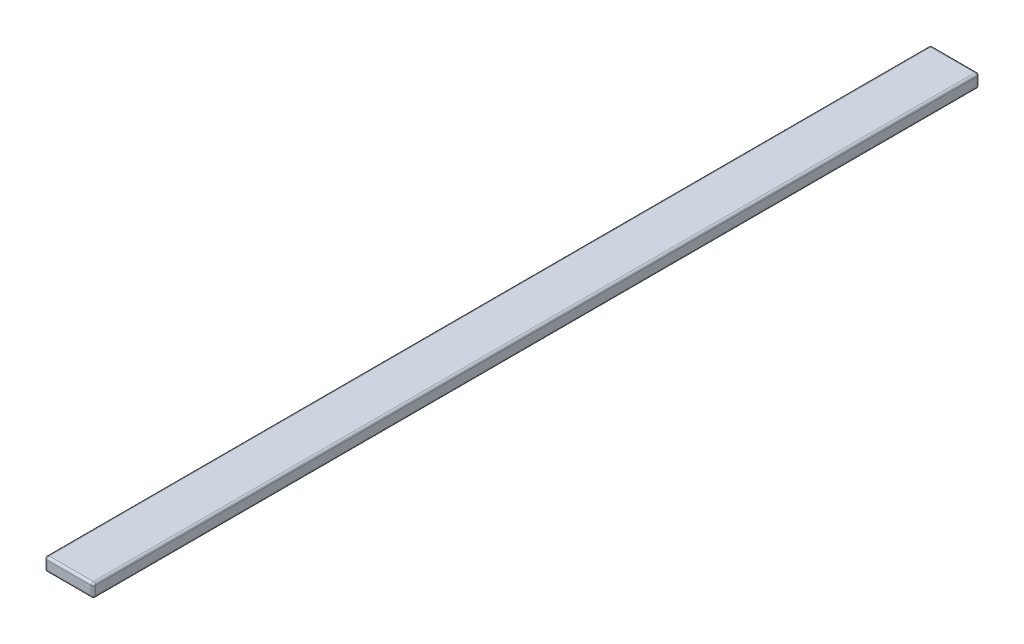
ISO-10303-21;
HEADER;
FILE_DESCRIPTION(('STEP AP214'),'2;1');
FILE_NAME('part.step','',(''),(''),'','','');
FILE_SCHEMA(('AUTOMOTIVE_DESIGN { 1 0 10303 214 1 1 1 1 }'));
ENDSEC;
DATA;
#1=APPLICATION_CONTEXT('core data for automotive mechanical design processes');
#2=APPLICATION_PROTOCOL_DEFINITION('international standard','automotive_design',2000,#1);
#3=PRODUCT_CONTEXT('',#1,'mechanical');
#4=PRODUCT('Part','Part','',(#3));
#5=PRODUCT_RELATED_PRODUCT_CATEGORY('part','',(#4));
#6=PRODUCT_DEFINITION_FORMATION('','',#4);
#7=PRODUCT_DEFINITION_CONTEXT('part definition',#1,'design');
#8=PRODUCT_DEFINITION('design','',#6,#7);
#9=PRODUCT_DEFINITION_SHAPE('','',#8);
#10=(LENGTH_UNIT() NAMED_UNIT(*) SI_UNIT(.MILLI.,.METRE.));
#11=(NAMED_UNIT(*) PLANE_ANGLE_UNIT() SI_UNIT($,.RADIAN.));
#12=(NAMED_UNIT(*) SI_UNIT($,.STERADIAN.) SOLID_ANGLE_UNIT());
#13=UNCERTAINTY_MEASURE_WITH_UNIT(LENGTH_MEASURE(1.E-05),#10,'distance_accuracy_value','');
#14=(GEOMETRIC_REPRESENTATION_CONTEXT(3) GLOBAL_UNCERTAINTY_ASSIGNED_CONTEXT((#13)) GLOBAL_UNIT_ASSIGNED_CONTEXT((#10,
#11,#12)) REPRESENTATION_CONTEXT('',''));
#15=CARTESIAN_POINT('',(0.,0.,0.));
#16=DIRECTION('',(0.,0.,1.));
#17=DIRECTION('',(1.,0.,0.));
#18=AXIS2_PLACEMENT_3D('',#15,#16,#17);
#19=CARTESIAN_POINT('',(11.,-3.,400.));
#20=DIRECTION('',(-1.,0.,0.));
#21=DIRECTION('',(0.,0.,1.));
#22=AXIS2_PLACEMENT_3D('',#19,#20,#21);
#23=PLANE('',#22);
#24=DIRECTION('',(0.,1.,0.));
#25=VECTOR('',#24,1.);
#26=CARTESIAN_POINT('',(11.,-3.,399.));
#27=LINE('',#26,#25);
#28=CARTESIAN_POINT('',(11.,2.,399.));
#29=VERTEX_POINT('',#28);
#30=CARTESIAN_POINT('',(11.,-2.,399.));
#31=VERTEX_POINT('',#30);
#32=EDGE_CURVE('E192',#29,#31,#27,.F.);
#33=ORIENTED_EDGE('',*,*,#32,.T.);
#34=DIRECTION('',(0.,0.,-1.));
#35=VECTOR('',#34,1.);
#36=CARTESIAN_POINT('',(11.,-2.,400.));
#37=LINE('',#36,#35);
#38=CARTESIAN_POINT('',(11.,-2.,1.));
#39=VERTEX_POINT('',#38);
#40=EDGE_CURVE('E195',#31,#39,#37,.T.);
#41=ORIENTED_EDGE('',*,*,#40,.T.);
#42=DIRECTION('',(0.,1.,0.));
#43=VECTOR('',#42,1.);
#44=CARTESIAN_POINT('',(11.,3.,1.));
#45=LINE('',#44,#43);
#46=CARTESIAN_POINT('',(11.,2.,1.));
#47=VERTEX_POINT('',#46);
#48=EDGE_CURVE('E190',#39,#47,#45,.T.);
#49=ORIENTED_EDGE('',*,*,#48,.T.);
#50=DIRECTION('',(0.,0.,-1.));
#51=VECTOR('',#50,1.);
#52=CARTESIAN_POINT('',(11.,2.,400.));
#53=LINE('',#52,#51);
#54=EDGE_CURVE('E188',#47,#29,#53,.F.);
#55=ORIENTED_EDGE('',*,*,#54,.T.);
#56=EDGE_LOOP('',(#33,#41,#49,#55));
#57=FACE_BOUND('',#56,.T.);
#58=ADVANCED_FACE('F36',(#57),#23,.F.);
#59=CARTESIAN_POINT('',(-11.,3.,400.));
#60=DIRECTION('',(0.,-1.,0.));
#61=DIRECTION('',(0.,0.,-1.));
#62=AXIS2_PLACEMENT_3D('',#59,#60,#61);
#63=PLANE('',#62);
#64=DIRECTION('',(-1.,0.,0.));
#65=VECTOR('',#64,1.);
#66=CARTESIAN_POINT('',(-11.,3.,1.));
#67=LINE('',#66,#65);
#68=CARTESIAN_POINT('',(10.,3.,1.));
#69=VERTEX_POINT('',#68);
#70=CARTESIAN_POINT('',(-10.,3.,1.));
#71=VERTEX_POINT('',#70);
#72=EDGE_CURVE('E181',#69,#71,#67,.T.);
#73=ORIENTED_EDGE('',*,*,#72,.T.);
#74=DIRECTION('',(0.,0.,-1.));
#75=VECTOR('',#74,1.);
#76=CARTESIAN_POINT('',(-10.,3.,400.));
#77=LINE('',#76,#75);
#78=CARTESIAN_POINT('',(-10.,3.,399.));
#79=VERTEX_POINT('',#78);
#80=EDGE_CURVE('E186',#71,#79,#77,.F.);
#81=ORIENTED_EDGE('',*,*,#80,.T.);
#82=DIRECTION('',(-1.,0.,0.));
#83=VECTOR('',#82,1.);
#84=CARTESIAN_POINT('',(-11.,3.,399.));
#85=LINE('',#84,#83);
#86=CARTESIAN_POINT('',(10.,3.,399.));
#87=VERTEX_POINT('',#86);
#88=EDGE_CURVE('E183',#79,#87,#85,.F.);
#89=ORIENTED_EDGE('',*,*,#88,.T.);
#90=DIRECTION('',(0.,0.,-1.));
#91=VECTOR('',#90,1.);
#92=CARTESIAN_POINT('',(10.,3.,400.));
#93=LINE('',#92,#91);
#94=EDGE_CURVE('E179',#87,#69,#93,.T.);
#95=ORIENTED_EDGE('',*,*,#94,.T.);
#96=EDGE_LOOP('',(#73,#81,#89,#95));
#97=FACE_BOUND('',#96,.T.);
#98=ADVANCED_FACE('F282',(#97),#63,.F.);
#99=CARTESIAN_POINT('',(-11.,-3.,400.));
#100=DIRECTION('',(1.,0.,0.));
#101=DIRECTION('',(0.,0.,-1.));
#102=AXIS2_PLACEMENT_3D('',#99,#100,#101);
#103=PLANE('',#102);
#104=DIRECTION('',(0.,-1.,0.));
#105=VECTOR('',#104,1.);
#106=CARTESIAN_POINT('',(-11.,-3.,399.));
#107=LINE('',#106,#105);
#108=CARTESIAN_POINT('',(-11.,-2.,399.));
#109=VERTEX_POINT('',#108);
#110=CARTESIAN_POINT('',(-11.,2.,399.));
#111=VERTEX_POINT('',#110);
#112=EDGE_CURVE('E174',#109,#111,#107,.F.);
#113=ORIENTED_EDGE('',*,*,#112,.T.);
#114=DIRECTION('',(0.,0.,-1.));
#115=VECTOR('',#114,1.);
#116=CARTESIAN_POINT('',(-11.,2.,400.));
#117=LINE('',#116,#115);
#118=CARTESIAN_POINT('',(-11.,2.,1.));
#119=VERTEX_POINT('',#118);
#120=EDGE_CURVE('E177',#111,#119,#117,.T.);
#121=ORIENTED_EDGE('',*,*,#120,.T.);
#122=DIRECTION('',(0.,-1.,0.));
#123=VECTOR('',#122,1.);
#124=CARTESIAN_POINT('',(-11.,-3.,1.));
#125=LINE('',#124,#123);
#126=CARTESIAN_POINT('',(-11.,-2.,1.));
#127=VERTEX_POINT('',#126);
#128=EDGE_CURVE('E172',#119,#127,#125,.T.);
#129=ORIENTED_EDGE('',*,*,#128,.T.);
#130=DIRECTION('',(0.,0.,-1.));
#131=VECTOR('',#130,1.);
#132=CARTESIAN_POINT('',(-11.,-2.,400.));
#133=LINE('',#132,#131);
#134=EDGE_CURVE('E170',#127,#109,#133,.F.);
#135=ORIENTED_EDGE('',*,*,#134,.T.);
#136=EDGE_LOOP('',(#113,#121,#129,#135));
#137=FACE_BOUND('',#136,.T.);
#138=ADVANCED_FACE('F273',(#137),#103,.F.);
#139=CARTESIAN_POINT('',(-11.,-3.,400.));
#140=DIRECTION('',(0.,1.,0.));
#141=DIRECTION('',(0.,0.,1.));
#142=AXIS2_PLACEMENT_3D('',#139,#140,#141);
#143=PLANE('',#142);
#144=DIRECTION('',(1.,0.,0.));
#145=VECTOR('',#144,1.);
#146=CARTESIAN_POINT('',(-11.,-3.,399.));
#147=LINE('',#146,#145);
#148=CARTESIAN_POINT('',(10.,-3.,399.));
#149=VERTEX_POINT('',#148);
#150=CARTESIAN_POINT('',(-10.,-3.,399.));
#151=VERTEX_POINT('',#150);
#152=EDGE_CURVE('E131',#149,#151,#147,.F.);
#153=ORIENTED_EDGE('',*,*,#152,.T.);
#154=DIRECTION('',(0.,0.,-1.));
#155=VECTOR('',#154,1.);
#156=CARTESIAN_POINT('',(-10.,-3.,400.));
#157=LINE('',#156,#155);
#158=CARTESIAN_POINT('',(-10.,-3.,1.));
#159=VERTEX_POINT('',#158);
#160=EDGE_CURVE('E168',#151,#159,#157,.T.);
#161=ORIENTED_EDGE('',*,*,#160,.T.);
#162=DIRECTION('',(1.,0.,0.));
#163=VECTOR('',#162,1.);
#164=CARTESIAN_POINT('',(11.,-3.,1.));
#165=LINE('',#164,#163);
#166=CARTESIAN_POINT('',(10.,-3.,1.));
#167=VERTEX_POINT('',#166);
#168=EDGE_CURVE('E161',#159,#167,#165,.T.);
#169=ORIENTED_EDGE('',*,*,#168,.T.);
#170=DIRECTION('',(0.,0.,-1.));
#171=VECTOR('',#170,1.);
#172=CARTESIAN_POINT('',(10.,-3.,400.));
#173=LINE('',#172,#171);
#174=EDGE_CURVE('E159',#167,#149,#173,.F.);
#175=ORIENTED_EDGE('',*,*,#174,.T.);
#176=EDGE_LOOP('',(#153,#161,#169,#175));
#177=FACE_BOUND('',#176,.T.);
#178=ADVANCED_FACE('F310',(#177),#143,.F.);
#179=CARTESIAN_POINT('',(0.,0.,400.));
#180=DIRECTION('',(0.,0.,-1.));
#181=DIRECTION('',(-1.,0.,0.));
#182=AXIS2_PLACEMENT_3D('',#179,#180,#181);
#183=PLANE('',#182);
#184=DIRECTION('',(0.,-1.,0.));
#185=VECTOR('',#184,1.);
#186=CARTESIAN_POINT('',(-10.,0.,400.));
#187=LINE('',#186,#185);
#188=CARTESIAN_POINT('',(-10.,2.,400.));
#189=VERTEX_POINT('',#188);
#190=CARTESIAN_POINT('',(-10.,-2.,400.));
#191=VERTEX_POINT('',#190);
#192=EDGE_CURVE('E157',#189,#191,#187,.T.);
#193=ORIENTED_EDGE('',*,*,#192,.T.);
#194=DIRECTION('',(1.,0.,0.));
#195=VECTOR('',#194,1.);
#196=CARTESIAN_POINT('',(0.,-2.,400.));
#197=LINE('',#196,#195);
#198=CARTESIAN_POINT('',(10.,-2.,400.));
#199=VERTEX_POINT('',#198);
#200=EDGE_CURVE('E129',#191,#199,#197,.T.);
#201=ORIENTED_EDGE('',*,*,#200,.T.);
#202=DIRECTION('',(0.,1.,0.));
#203=VECTOR('',#202,1.);
#204=CARTESIAN_POINT('',(10.,0.,400.));
#205=LINE('',#204,#203);
#206=CARTESIAN_POINT('',(10.,2.,400.));
#207=VERTEX_POINT('',#206);
#208=EDGE_CURVE('E147',#199,#207,#205,.T.);
#209=ORIENTED_EDGE('',*,*,#208,.T.);
#210=DIRECTION('',(-1.,0.,0.));
#211=VECTOR('',#210,1.);
#212=CARTESIAN_POINT('',(0.,2.,400.));
#213=LINE('',#212,#211);
#214=EDGE_CURVE('E153',#207,#189,#213,.T.);
#215=ORIENTED_EDGE('',*,*,#214,.T.);
#216=EDGE_LOOP('',(#193,#201,#209,#215));
#217=FACE_BOUND('',#216,.T.);
#218=ADVANCED_FACE('F155',(#217),#183,.F.);
#219=CARTESIAN_POINT('',(0.,0.,0.));
#220=DIRECTION('',(0.,0.,-1.));
#221=DIRECTION('',(-1.,0.,0.));
#222=AXIS2_PLACEMENT_3D('',#219,#220,#221);
#223=PLANE('',#222);
#224=DIRECTION('',(0.,-1.,0.));
#225=VECTOR('',#224,1.);
#226=CARTESIAN_POINT('',(-10.,3.,0.));
#227=LINE('',#226,#225);
#228=CARTESIAN_POINT('',(-10.,-2.,0.));
#229=VERTEX_POINT('',#228);
#230=CARTESIAN_POINT('',(-10.,2.,0.));
#231=VERTEX_POINT('',#230);
#232=EDGE_CURVE('E45',#229,#231,#227,.F.);
#233=ORIENTED_EDGE('',*,*,#232,.T.);
#234=DIRECTION('',(-1.,0.,0.));
#235=VECTOR('',#234,1.);
#236=CARTESIAN_POINT('',(11.,2.,0.));
#237=LINE('',#236,#235);
#238=CARTESIAN_POINT('',(10.,2.,0.));
#239=VERTEX_POINT('',#238);
#240=EDGE_CURVE('E11',#231,#239,#237,.F.);
#241=ORIENTED_EDGE('',*,*,#240,.T.);
#242=DIRECTION('',(0.,1.,0.));
#243=VECTOR('',#242,1.);
#244=CARTESIAN_POINT('',(10.,-3.,0.));
#245=LINE('',#244,#243);
#246=CARTESIAN_POINT('',(10.,-2.,0.));
#247=VERTEX_POINT('',#246);
#248=EDGE_CURVE('E197',#239,#247,#245,.F.);
#249=ORIENTED_EDGE('',*,*,#248,.T.);
#250=DIRECTION('',(1.,0.,0.));
#251=VECTOR('',#250,1.);
#252=CARTESIAN_POINT('',(-11.,-2.,0.));
#253=LINE('',#252,#251);
#254=EDGE_CURVE('E56',#247,#229,#253,.F.);
#255=ORIENTED_EDGE('',*,*,#254,.T.);
#256=EDGE_LOOP('',(#233,#241,#249,#255));
#257=FACE_BOUND('',#256,.T.);
#258=ADVANCED_FACE('F294',(#257),#223,.T.);
#259=CARTESIAN_POINT('',(-11.,2.,1.));
#260=DIRECTION('',(1.,0.,0.));
#261=DIRECTION('',(0.,0.,-1.));
#262=AXIS2_PLACEMENT_3D('',#259,#260,#261);
#263=CYLINDRICAL_SURFACE('',#262,1.);
#264=CARTESIAN_POINT('',(-10.,2.,1.));
#265=DIRECTION('',(-1.,0.,0.));
#266=DIRECTION('',(0.,0.,1.));
#267=AXIS2_PLACEMENT_3D('',#264,#265,#266);
#268=CIRCLE('',#267,1.);
#269=EDGE_CURVE('E40',#71,#231,#268,.T.);
#270=ORIENTED_EDGE('',*,*,#269,.F.);
#271=ORIENTED_EDGE('',*,*,#72,.F.);
#272=CARTESIAN_POINT('',(10.,2.,1.));
#273=DIRECTION('',(1.,0.,0.));
#274=DIRECTION('',(0.,1.,0.));
#275=AXIS2_PLACEMENT_3D('',#272,#273,#274);
#276=CIRCLE('',#275,1.);
#277=EDGE_CURVE('E251',#239,#69,#276,.T.);
#278=ORIENTED_EDGE('',*,*,#277,.F.);
#279=ORIENTED_EDGE('',*,*,#240,.F.);
#280=EDGE_LOOP('',(#270,#271,#278,#279));
#281=FACE_BOUND('',#280,.T.);
#282=ADVANCED_FACE('F38',(#281),#263,.T.);
#283=CARTESIAN_POINT('',(-10.,2.,1.));
#284=DIRECTION('',(0.,0.,1.));
#285=DIRECTION('',(1.,0.,0.));
#286=AXIS2_PLACEMENT_3D('',#283,#284,#285);
#287=SPHERICAL_SURFACE('',#286,1.);
#288=CARTESIAN_POINT('',(-10.,2.,1.));
#289=DIRECTION('',(0.,0.,-1.));
#290=DIRECTION('',(-1.,0.,0.));
#291=AXIS2_PLACEMENT_3D('',#288,#289,#290);
#292=CIRCLE('',#291,1.);
#293=EDGE_CURVE('E246',#71,#119,#292,.F.);
#294=ORIENTED_EDGE('',*,*,#293,.F.);
#295=ORIENTED_EDGE('',*,*,#269,.T.);
#296=CARTESIAN_POINT('',(-10.,2.,1.));
#297=DIRECTION('',(0.,1.,0.));
#298=DIRECTION('',(0.,0.,1.));
#299=AXIS2_PLACEMENT_3D('',#296,#297,#298);
#300=CIRCLE('',#299,1.);
#301=EDGE_CURVE('E249',#119,#231,#300,.F.);
#302=ORIENTED_EDGE('',*,*,#301,.F.);
#303=EDGE_LOOP('',(#294,#295,#302));
#304=FACE_BOUND('',#303,.T.);
#305=ADVANCED_FACE('F262',(#304),#287,.T.);
#306=CARTESIAN_POINT('',(10.,2.,1.));
#307=DIRECTION('',(0.,0.,1.));
#308=DIRECTION('',(1.,0.,0.));
#309=AXIS2_PLACEMENT_3D('',#306,#307,#308);
#310=SPHERICAL_SURFACE('',#309,1.);
#311=CARTESIAN_POINT('',(10.,2.,1.));
#312=DIRECTION('',(0.,1.,0.));
#313=DIRECTION('',(0.,0.,1.));
#314=AXIS2_PLACEMENT_3D('',#311,#312,#313);
#315=CIRCLE('',#314,1.);
#316=EDGE_CURVE('E240',#239,#47,#315,.F.);
#317=ORIENTED_EDGE('',*,*,#316,.F.);
#318=ORIENTED_EDGE('',*,*,#277,.T.);
#319=CARTESIAN_POINT('',(10.,2.,1.));
#320=DIRECTION('',(0.,0.,-1.));
#321=DIRECTION('',(-1.,0.,0.));
#322=AXIS2_PLACEMENT_3D('',#319,#320,#321);
#323=CIRCLE('',#322,1.);
#324=EDGE_CURVE('E243',#47,#69,#323,.F.);
#325=ORIENTED_EDGE('',*,*,#324,.F.);
#326=EDGE_LOOP('',(#317,#318,#325));
#327=FACE_BOUND('',#326,.T.);
#328=ADVANCED_FACE('F461',(#327),#310,.T.);
#329=CARTESIAN_POINT('',(-10.,-3.,1.));
#330=DIRECTION('',(0.,1.,0.));
#331=DIRECTION('',(0.,0.,1.));
#332=AXIS2_PLACEMENT_3D('',#329,#330,#331);
#333=CYLINDRICAL_SURFACE('',#332,1.);
#334=ORIENTED_EDGE('',*,*,#301,.T.);
#335=ORIENTED_EDGE('',*,*,#232,.F.);
#336=CARTESIAN_POINT('',(-10.,-2.,1.));
#337=DIRECTION('',(0.,-1.,0.));
#338=DIRECTION('',(0.,0.,-1.));
#339=AXIS2_PLACEMENT_3D('',#336,#337,#338);
#340=CIRCLE('',#339,1.);
#341=EDGE_CURVE('E234',#127,#229,#340,.T.);
#342=ORIENTED_EDGE('',*,*,#341,.F.);
#343=ORIENTED_EDGE('',*,*,#128,.F.);
#344=EDGE_LOOP('',(#334,#335,#342,#343));
#345=FACE_BOUND('',#344,.T.);
#346=ADVANCED_FACE('F268',(#345),#333,.T.);
#347=CARTESIAN_POINT('',(-10.,2.,400.));
#348=DIRECTION('',(0.,0.,-1.));
#349=DIRECTION('',(-1.,0.,0.));
#350=AXIS2_PLACEMENT_3D('',#347,#348,#349);
#351=CYLINDRICAL_SURFACE('',#350,1.);
#352=ORIENTED_EDGE('',*,*,#293,.T.);
#353=ORIENTED_EDGE('',*,*,#120,.F.);
#354=CARTESIAN_POINT('',(-10.,2.,399.));
#355=DIRECTION('',(0.,0.,1.));
#356=DIRECTION('',(1.,0.,0.));
#357=AXIS2_PLACEMENT_3D('',#354,#355,#356);
#358=CIRCLE('',#357,1.);
#359=EDGE_CURVE('E231',#79,#111,#358,.T.);
#360=ORIENTED_EDGE('',*,*,#359,.F.);
#361=ORIENTED_EDGE('',*,*,#80,.F.);
#362=EDGE_LOOP('',(#352,#353,#360,#361));
#363=FACE_BOUND('',#362,.T.);
#364=ADVANCED_FACE('F279',(#363),#351,.T.);
#365=CARTESIAN_POINT('',(0.,2.,399.));
#366=DIRECTION('',(-1.,0.,0.));
#367=DIRECTION('',(0.,0.,1.));
#368=AXIS2_PLACEMENT_3D('',#365,#366,#367);
#369=CYLINDRICAL_SURFACE('',#368,1.);
#370=CARTESIAN_POINT('',(10.,2.,399.));
#371=DIRECTION('',(1.,0.,0.));
#372=DIRECTION('',(0.,0.,-1.));
#373=AXIS2_PLACEMENT_3D('',#370,#371,#372);
#374=CIRCLE('',#373,1.);
#375=EDGE_CURVE('E225',#87,#207,#374,.T.);
#376=ORIENTED_EDGE('',*,*,#375,.F.);
#377=ORIENTED_EDGE('',*,*,#88,.F.);
#378=CARTESIAN_POINT('',(-10.,2.,399.));
#379=DIRECTION('',(-1.,0.,0.));
#380=DIRECTION('',(0.,0.,1.));
#381=AXIS2_PLACEMENT_3D('',#378,#379,#380);
#382=CIRCLE('',#381,1.);
#383=EDGE_CURVE('E228',#189,#79,#382,.T.);
#384=ORIENTED_EDGE('',*,*,#383,.F.);
#385=ORIENTED_EDGE('',*,*,#214,.F.);
#386=EDGE_LOOP('',(#376,#377,#384,#385));
#387=FACE_BOUND('',#386,.T.);
#388=ADVANCED_FACE('F286',(#387),#369,.T.);
#389=CARTESIAN_POINT('',(10.,2.,400.));
#390=DIRECTION('',(0.,0.,-1.));
#391=DIRECTION('',(-1.,0.,0.));
#392=AXIS2_PLACEMENT_3D('',#389,#390,#391);
#393=CYLINDRICAL_SURFACE('',#392,1.);
#394=ORIENTED_EDGE('',*,*,#324,.T.);
#395=ORIENTED_EDGE('',*,*,#94,.F.);
#396=CARTESIAN_POINT('',(10.,2.,399.));
#397=DIRECTION('',(0.,0.,1.));
#398=DIRECTION('',(1.,0.,0.));
#399=AXIS2_PLACEMENT_3D('',#396,#397,#398);
#400=CIRCLE('',#399,1.);
#401=EDGE_CURVE('E223',#29,#87,#400,.T.);
#402=ORIENTED_EDGE('',*,*,#401,.F.);
#403=ORIENTED_EDGE('',*,*,#54,.F.);
#404=EDGE_LOOP('',(#394,#395,#402,#403));
#405=FACE_BOUND('',#404,.T.);
#406=ADVANCED_FACE('F292',(#405),#393,.T.);
#407=CARTESIAN_POINT('',(10.,-3.,1.));
#408=DIRECTION('',(0.,-1.,0.));
#409=DIRECTION('',(0.,0.,-1.));
#410=AXIS2_PLACEMENT_3D('',#407,#408,#409);
#411=CYLINDRICAL_SURFACE('',#410,1.);
#412=ORIENTED_EDGE('',*,*,#316,.T.);
#413=ORIENTED_EDGE('',*,*,#48,.F.);
#414=CARTESIAN_POINT('',(10.,-2.,1.));
#415=DIRECTION('',(0.,-1.,0.));
#416=DIRECTION('',(0.,0.,-1.));
#417=AXIS2_PLACEMENT_3D('',#414,#415,#416);
#418=CIRCLE('',#417,1.);
#419=EDGE_CURVE('E220',#247,#39,#418,.T.);
#420=ORIENTED_EDGE('',*,*,#419,.F.);
#421=ORIENTED_EDGE('',*,*,#248,.F.);
#422=EDGE_LOOP('',(#412,#413,#420,#421));
#423=FACE_BOUND('',#422,.T.);
#424=ADVANCED_FACE('F303',(#423),#411,.T.);
#425=CARTESIAN_POINT('',(-11.,-2.,1.));
#426=DIRECTION('',(-1.,0.,0.));
#427=DIRECTION('',(0.,0.,1.));
#428=AXIS2_PLACEMENT_3D('',#425,#426,#427);
#429=CYLINDRICAL_SURFACE('',#428,1.);
#430=CARTESIAN_POINT('',(-10.,-2.,1.));
#431=DIRECTION('',(-1.,0.,0.));
#432=DIRECTION('',(0.,0.,1.));
#433=AXIS2_PLACEMENT_3D('',#430,#431,#432);
#434=CIRCLE('',#433,1.);
#435=EDGE_CURVE('E237',#229,#159,#434,.T.);
#436=ORIENTED_EDGE('',*,*,#435,.F.);
#437=ORIENTED_EDGE('',*,*,#254,.F.);
#438=CARTESIAN_POINT('',(10.,-2.,1.));
#439=DIRECTION('',(1.,0.,0.));
#440=DIRECTION('',(0.,0.,-1.));
#441=AXIS2_PLACEMENT_3D('',#438,#439,#440);
#442=CIRCLE('',#441,1.);
#443=EDGE_CURVE('E217',#167,#247,#442,.T.);
#444=ORIENTED_EDGE('',*,*,#443,.F.);
#445=ORIENTED_EDGE('',*,*,#168,.F.);
#446=EDGE_LOOP('',(#436,#437,#444,#445));
#447=FACE_BOUND('',#446,.T.);
#448=ADVANCED_FACE('F299',(#447),#429,.T.);
#449=CARTESIAN_POINT('',(-10.,-2.,1.));
#450=DIRECTION('',(0.,0.,1.));
#451=DIRECTION('',(1.,0.,0.));
#452=AXIS2_PLACEMENT_3D('',#449,#450,#451);
#453=SPHERICAL_SURFACE('',#452,1.);
#454=ORIENTED_EDGE('',*,*,#341,.T.);
#455=ORIENTED_EDGE('',*,*,#435,.T.);
#456=CARTESIAN_POINT('',(-10.,-2.,1.));
#457=DIRECTION('',(0.,0.,-1.));
#458=DIRECTION('',(-1.,0.,0.));
#459=AXIS2_PLACEMENT_3D('',#456,#457,#458);
#460=CIRCLE('',#459,1.);
#461=EDGE_CURVE('E214',#127,#159,#460,.F.);
#462=ORIENTED_EDGE('',*,*,#461,.F.);
#463=EDGE_LOOP('',(#454,#455,#462));
#464=FACE_BOUND('',#463,.T.);
#465=ADVANCED_FACE('F313',(#464),#453,.T.);
#466=CARTESIAN_POINT('',(-10.,2.,399.));
#467=DIRECTION('',(0.,0.,1.));
#468=DIRECTION('',(1.,0.,0.));
#469=AXIS2_PLACEMENT_3D('',#466,#467,#468);
#470=SPHERICAL_SURFACE('',#469,1.);
#471=ORIENTED_EDGE('',*,*,#383,.T.);
#472=ORIENTED_EDGE('',*,*,#359,.T.);
#473=CARTESIAN_POINT('',(-10.,2.,399.));
#474=DIRECTION('',(0.,1.,0.));
#475=DIRECTION('',(0.,0.,1.));
#476=AXIS2_PLACEMENT_3D('',#473,#474,#475);
#477=CIRCLE('',#476,1.);
#478=EDGE_CURVE('E212',#189,#111,#477,.F.);
#479=ORIENTED_EDGE('',*,*,#478,.F.);
#480=EDGE_LOOP('',(#471,#472,#479));
#481=FACE_BOUND('',#480,.T.);
#482=ADVANCED_FACE('F323',(#481),#470,.T.);
#483=CARTESIAN_POINT('',(10.,2.,399.));
#484=DIRECTION('',(0.,0.,1.));
#485=DIRECTION('',(1.,0.,0.));
#486=AXIS2_PLACEMENT_3D('',#483,#484,#485);
#487=SPHERICAL_SURFACE('',#486,1.);
#488=ORIENTED_EDGE('',*,*,#401,.T.);
#489=ORIENTED_EDGE('',*,*,#375,.T.);
#490=CARTESIAN_POINT('',(10.,2.,399.));
#491=DIRECTION('',(0.,1.,0.));
#492=DIRECTION('',(0.,0.,1.));
#493=AXIS2_PLACEMENT_3D('',#490,#491,#492);
#494=CIRCLE('',#493,1.);
#495=EDGE_CURVE('E150',#29,#207,#494,.F.);
#496=ORIENTED_EDGE('',*,*,#495,.F.);
#497=EDGE_LOOP('',(#488,#489,#496));
#498=FACE_BOUND('',#497,.T.);
#499=ADVANCED_FACE('F325',(#498),#487,.T.);
#500=CARTESIAN_POINT('',(10.,-2.,1.));
#501=DIRECTION('',(0.,0.,1.));
#502=DIRECTION('',(1.,0.,0.));
#503=AXIS2_PLACEMENT_3D('',#500,#501,#502);
#504=SPHERICAL_SURFACE('',#503,1.);
#505=ORIENTED_EDGE('',*,*,#443,.T.);
#506=ORIENTED_EDGE('',*,*,#419,.T.);
#507=CARTESIAN_POINT('',(10.,-2.,1.));
#508=DIRECTION('',(0.,0.,-1.));
#509=DIRECTION('',(-1.,0.,0.));
#510=AXIS2_PLACEMENT_3D('',#507,#508,#509);
#511=CIRCLE('',#510,1.);
#512=EDGE_CURVE('E208',#167,#39,#511,.F.);
#513=ORIENTED_EDGE('',*,*,#512,.F.);
#514=EDGE_LOOP('',(#505,#506,#513));
#515=FACE_BOUND('',#514,.T.);
#516=ADVANCED_FACE('F305',(#515),#504,.T.);
#517=CARTESIAN_POINT('',(-10.,-2.,400.));
#518=DIRECTION('',(0.,0.,-1.));
#519=DIRECTION('',(-1.,0.,0.));
#520=AXIS2_PLACEMENT_3D('',#517,#518,#519);
#521=CYLINDRICAL_SURFACE('',#520,1.);
#522=ORIENTED_EDGE('',*,*,#461,.T.);
#523=ORIENTED_EDGE('',*,*,#160,.F.);
#524=CARTESIAN_POINT('',(-10.,-2.,399.));
#525=DIRECTION('',(0.,0.,1.));
#526=DIRECTION('',(1.,0.,0.));
#527=AXIS2_PLACEMENT_3D('',#524,#525,#526);
#528=CIRCLE('',#527,1.);
#529=EDGE_CURVE('E205',#109,#151,#528,.T.);
#530=ORIENTED_EDGE('',*,*,#529,.F.);
#531=ORIENTED_EDGE('',*,*,#134,.F.);
#532=EDGE_LOOP('',(#522,#523,#530,#531));
#533=FACE_BOUND('',#532,.T.);
#534=ADVANCED_FACE('F315',(#533),#521,.T.);
#535=CARTESIAN_POINT('',(-10.,0.,399.));
#536=DIRECTION('',(0.,-1.,0.));
#537=DIRECTION('',(0.,0.,-1.));
#538=AXIS2_PLACEMENT_3D('',#535,#536,#537);
#539=CYLINDRICAL_SURFACE('',#538,1.);
#540=ORIENTED_EDGE('',*,*,#478,.T.);
#541=ORIENTED_EDGE('',*,*,#112,.F.);
#542=CARTESIAN_POINT('',(-10.,-2.,399.));
#543=DIRECTION('',(0.,-1.,0.));
#544=DIRECTION('',(0.,0.,-1.));
#545=AXIS2_PLACEMENT_3D('',#542,#543,#544);
#546=CIRCLE('',#545,1.);
#547=EDGE_CURVE('E144',#191,#109,#546,.T.);
#548=ORIENTED_EDGE('',*,*,#547,.F.);
#549=ORIENTED_EDGE('',*,*,#192,.F.);
#550=EDGE_LOOP('',(#540,#541,#548,#549));
#551=FACE_BOUND('',#550,.T.);
#552=ADVANCED_FACE('F321',(#551),#539,.T.);
#553=CARTESIAN_POINT('',(10.,0.,399.));
#554=DIRECTION('',(0.,1.,0.));
#555=DIRECTION('',(0.,0.,1.));
#556=AXIS2_PLACEMENT_3D('',#553,#554,#555);
#557=CYLINDRICAL_SURFACE('',#556,1.);
#558=ORIENTED_EDGE('',*,*,#495,.T.);
#559=ORIENTED_EDGE('',*,*,#208,.F.);
#560=CARTESIAN_POINT('',(10.,-2.,399.));
#561=DIRECTION('',(0.,-1.,0.));
#562=DIRECTION('',(0.,0.,-1.));
#563=AXIS2_PLACEMENT_3D('',#560,#561,#562);
#564=CIRCLE('',#563,1.);
#565=EDGE_CURVE('E136',#31,#199,#564,.T.);
#566=ORIENTED_EDGE('',*,*,#565,.F.);
#567=ORIENTED_EDGE('',*,*,#32,.F.);
#568=EDGE_LOOP('',(#558,#559,#566,#567));
#569=FACE_BOUND('',#568,.T.);
#570=ADVANCED_FACE('F148',(#569),#557,.T.);
#571=CARTESIAN_POINT('',(10.,-2.,400.));
#572=DIRECTION('',(0.,0.,-1.));
#573=DIRECTION('',(-1.,0.,0.));
#574=AXIS2_PLACEMENT_3D('',#571,#572,#573);
#575=CYLINDRICAL_SURFACE('',#574,1.);
#576=ORIENTED_EDGE('',*,*,#512,.T.);
#577=ORIENTED_EDGE('',*,*,#40,.F.);
#578=CARTESIAN_POINT('',(10.,-2.,399.));
#579=DIRECTION('',(0.,0.,1.));
#580=DIRECTION('',(1.,0.,0.));
#581=AXIS2_PLACEMENT_3D('',#578,#579,#580);
#582=CIRCLE('',#581,1.);
#583=EDGE_CURVE('E140',#149,#31,#582,.T.);
#584=ORIENTED_EDGE('',*,*,#583,.F.);
#585=ORIENTED_EDGE('',*,*,#174,.F.);
#586=EDGE_LOOP('',(#576,#577,#584,#585));
#587=FACE_BOUND('',#586,.T.);
#588=ADVANCED_FACE('F308',(#587),#575,.T.);
#589=CARTESIAN_POINT('',(-10.,-2.,399.));
#590=DIRECTION('',(0.,0.,1.));
#591=DIRECTION('',(1.,0.,0.));
#592=AXIS2_PLACEMENT_3D('',#589,#590,#591);
#593=SPHERICAL_SURFACE('',#592,1.);
#594=ORIENTED_EDGE('',*,*,#547,.T.);
#595=ORIENTED_EDGE('',*,*,#529,.T.);
#596=CARTESIAN_POINT('',(-10.,-2.,399.));
#597=DIRECTION('',(-1.,0.,0.));
#598=DIRECTION('',(0.,0.,1.));
#599=AXIS2_PLACEMENT_3D('',#596,#597,#598);
#600=CIRCLE('',#599,1.);
#601=EDGE_CURVE('E133',#191,#151,#600,.F.);
#602=ORIENTED_EDGE('',*,*,#601,.F.);
#603=EDGE_LOOP('',(#594,#595,#602));
#604=FACE_BOUND('',#603,.T.);
#605=ADVANCED_FACE('F319',(#604),#593,.T.);
#606=CARTESIAN_POINT('',(10.,-2.,399.));
#607=DIRECTION('',(0.,0.,1.));
#608=DIRECTION('',(1.,0.,0.));
#609=AXIS2_PLACEMENT_3D('',#606,#607,#608);
#610=SPHERICAL_SURFACE('',#609,1.);
#611=ORIENTED_EDGE('',*,*,#583,.T.);
#612=ORIENTED_EDGE('',*,*,#565,.T.);
#613=CARTESIAN_POINT('',(10.,-2.,399.));
#614=DIRECTION('',(1.,0.,0.));
#615=DIRECTION('',(0.,0.,-1.));
#616=AXIS2_PLACEMENT_3D('',#613,#614,#615);
#617=CIRCLE('',#616,1.);
#618=EDGE_CURVE('E125',#149,#199,#617,.F.);
#619=ORIENTED_EDGE('',*,*,#618,.F.);
#620=EDGE_LOOP('',(#611,#612,#619));
#621=FACE_BOUND('',#620,.T.);
#622=ADVANCED_FACE('F138',(#621),#610,.T.);
#623=CARTESIAN_POINT('',(0.,-2.,399.));
#624=DIRECTION('',(1.,0.,0.));
#625=DIRECTION('',(0.,0.,-1.));
#626=AXIS2_PLACEMENT_3D('',#623,#624,#625);
#627=CYLINDRICAL_SURFACE('',#626,1.);
#628=ORIENTED_EDGE('',*,*,#601,.T.);
#629=ORIENTED_EDGE('',*,*,#152,.F.);
#630=ORIENTED_EDGE('',*,*,#618,.T.);
#631=ORIENTED_EDGE('',*,*,#200,.F.);
#632=EDGE_LOOP('',(#628,#629,#630,#631));
#633=FACE_BOUND('',#632,.T.);
#634=ADVANCED_FACE('F127',(#633),#627,.T.);
#635=CLOSED_SHELL('',(#58,#98,#138,#178,#218,#258,#282,#305,#328,#346,#364,#388,#406,#424,#448,
#465,#482,#499,#516,#534,#552,#570,#588,#605,#622,#634));
#636=MANIFOLD_SOLID_BREP('B2',#635);
#637=ADVANCED_BREP_SHAPE_REPRESENTATION('',(#18,#636),#14);
#638=SHAPE_DEFINITION_REPRESENTATION(#9,#637);
ENDSEC;
END-ISO-10303-21;
